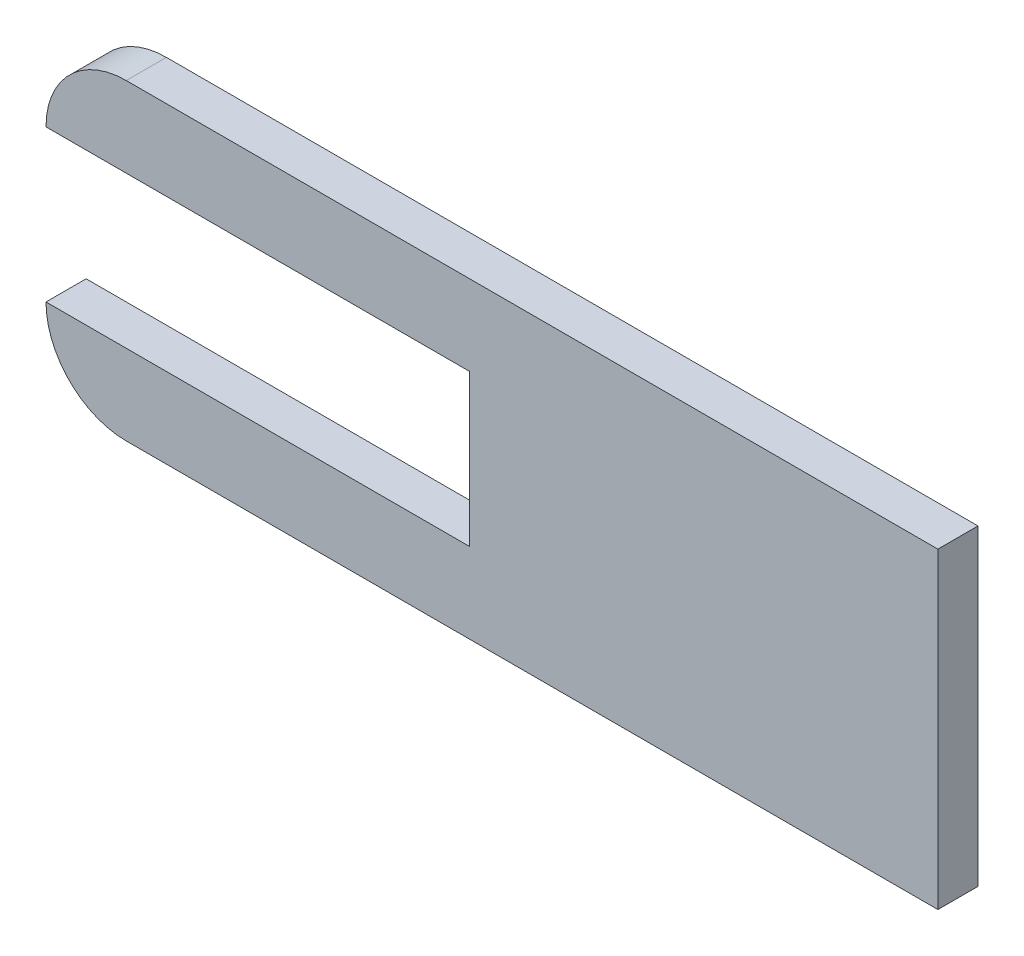
ISO-10303-21;
HEADER;
FILE_DESCRIPTION(('STEP AP214'),'2;1');
FILE_NAME('part.step','',(''),(''),'','','');
FILE_SCHEMA(('AUTOMOTIVE_DESIGN { 1 0 10303 214 1 1 1 1 }'));
ENDSEC;
DATA;
#1=APPLICATION_CONTEXT('core data for automotive mechanical design processes');
#2=APPLICATION_PROTOCOL_DEFINITION('international standard','automotive_design',2000,#1);
#3=PRODUCT_CONTEXT('',#1,'mechanical');
#4=PRODUCT('Part','Part','',(#3));
#5=PRODUCT_RELATED_PRODUCT_CATEGORY('part','',(#4));
#6=PRODUCT_DEFINITION_FORMATION('','',#4);
#7=PRODUCT_DEFINITION_CONTEXT('part definition',#1,'design');
#8=PRODUCT_DEFINITION('design','',#6,#7);
#9=PRODUCT_DEFINITION_SHAPE('','',#8);
#10=(LENGTH_UNIT() NAMED_UNIT(*) SI_UNIT(.MILLI.,.METRE.));
#11=(NAMED_UNIT(*) PLANE_ANGLE_UNIT() SI_UNIT($,.RADIAN.));
#12=(NAMED_UNIT(*) SI_UNIT($,.STERADIAN.) SOLID_ANGLE_UNIT());
#13=UNCERTAINTY_MEASURE_WITH_UNIT(LENGTH_MEASURE(1.E-05),#10,'distance_accuracy_value','');
#14=(GEOMETRIC_REPRESENTATION_CONTEXT(3) GLOBAL_UNCERTAINTY_ASSIGNED_CONTEXT((#13)) GLOBAL_UNIT_ASSIGNED_CONTEXT((#10,
#11,#12)) REPRESENTATION_CONTEXT('',''));
#15=CARTESIAN_POINT('',(0.,0.,0.));
#16=DIRECTION('',(0.,0.,1.));
#17=DIRECTION('',(1.,0.,0.));
#18=AXIS2_PLACEMENT_3D('',#15,#16,#17);
#19=CARTESIAN_POINT('',(22.86,22.86,11.43));
#20=DIRECTION('',(0.,0.,-1.));
#21=DIRECTION('',(-1.,0.,0.));
#22=AXIS2_PLACEMENT_3D('',#19,#20,#21);
#23=CYLINDRICAL_SURFACE('',#22,22.86);
#24=DIRECTION('',(0.,0.,-1.));
#25=VECTOR('',#24,1.);
#26=CARTESIAN_POINT('',(22.86,0.,11.43));
#27=LINE('',#26,#25);
#28=CARTESIAN_POINT('',(22.86,0.,11.43));
#29=VERTEX_POINT('',#28);
#30=CARTESIAN_POINT('',(22.86,0.,0.));
#31=VERTEX_POINT('',#30);
#32=EDGE_CURVE('E151',#29,#31,#27,.T.);
#33=ORIENTED_EDGE('',*,*,#32,.F.);
#34=CARTESIAN_POINT('',(22.86,22.86,11.43));
#35=DIRECTION('',(0.,0.,-1.));
#36=DIRECTION('',(-1.,0.,0.));
#37=AXIS2_PLACEMENT_3D('',#34,#35,#36);
#38=CIRCLE('',#37,22.86);
#39=CARTESIAN_POINT('',(0.,22.86,11.43));
#40=VERTEX_POINT('',#39);
#41=EDGE_CURVE('E40',#40,#29,#38,.F.);
#42=ORIENTED_EDGE('',*,*,#41,.F.);
#43=DIRECTION('',(0.,0.,-1.));
#44=VECTOR('',#43,1.);
#45=CARTESIAN_POINT('',(0.,22.86,11.43));
#46=LINE('',#45,#44);
#47=CARTESIAN_POINT('',(0.,22.86,0.));
#48=VERTEX_POINT('',#47);
#49=EDGE_CURVE('E154',#48,#40,#46,.F.);
#50=ORIENTED_EDGE('',*,*,#49,.F.);
#51=CARTESIAN_POINT('',(22.86,22.86,0.));
#52=DIRECTION('',(0.,0.,-1.));
#53=DIRECTION('',(-1.,0.,0.));
#54=AXIS2_PLACEMENT_3D('',#51,#52,#53);
#55=CIRCLE('',#54,22.86);
#56=EDGE_CURVE('E11',#31,#48,#55,.T.);
#57=ORIENTED_EDGE('',*,*,#56,.F.);
#58=EDGE_LOOP('',(#33,#42,#50,#57));
#59=FACE_BOUND('',#58,.T.);
#60=ADVANCED_FACE('F33',(#59),#23,.T.);
#61=CARTESIAN_POINT('',(22.86,66.04,11.43));
#62=DIRECTION('',(0.,0.,-1.));
#63=DIRECTION('',(-1.,0.,0.));
#64=AXIS2_PLACEMENT_3D('',#61,#62,#63);
#65=CYLINDRICAL_SURFACE('',#64,22.86);
#66=DIRECTION('',(0.,0.,-1.));
#67=VECTOR('',#66,1.);
#68=CARTESIAN_POINT('',(0.,66.04,11.43));
#69=LINE('',#68,#67);
#70=CARTESIAN_POINT('',(0.,66.04,11.43));
#71=VERTEX_POINT('',#70);
#72=CARTESIAN_POINT('',(0.,66.04,0.));
#73=VERTEX_POINT('',#72);
#74=EDGE_CURVE('E141',#71,#73,#69,.T.);
#75=ORIENTED_EDGE('',*,*,#74,.F.);
#76=CARTESIAN_POINT('',(22.86,66.04,11.43));
#77=DIRECTION('',(0.,0.,-1.));
#78=DIRECTION('',(-1.,0.,0.));
#79=AXIS2_PLACEMENT_3D('',#76,#77,#78);
#80=CIRCLE('',#79,22.86);
#81=CARTESIAN_POINT('',(22.86,88.9,11.43));
#82=VERTEX_POINT('',#81);
#83=EDGE_CURVE('E146',#82,#71,#80,.F.);
#84=ORIENTED_EDGE('',*,*,#83,.F.);
#85=DIRECTION('',(0.,0.,-1.));
#86=VECTOR('',#85,1.);
#87=CARTESIAN_POINT('',(22.86,88.9,11.43));
#88=LINE('',#87,#86);
#89=CARTESIAN_POINT('',(22.86,88.9,0.));
#90=VERTEX_POINT('',#89);
#91=EDGE_CURVE('E143',#90,#82,#88,.F.);
#92=ORIENTED_EDGE('',*,*,#91,.F.);
#93=CARTESIAN_POINT('',(22.86,66.04,0.));
#94=DIRECTION('',(0.,0.,-1.));
#95=DIRECTION('',(-1.,0.,0.));
#96=AXIS2_PLACEMENT_3D('',#93,#94,#95);
#97=CIRCLE('',#96,22.86);
#98=EDGE_CURVE('E149',#73,#90,#97,.T.);
#99=ORIENTED_EDGE('',*,*,#98,.F.);
#100=EDGE_LOOP('',(#75,#84,#92,#99));
#101=FACE_BOUND('',#100,.T.);
#102=ADVANCED_FACE('F175',(#101),#65,.T.);
#103=CARTESIAN_POINT('',(0.,0.,11.43));
#104=DIRECTION('',(0.,1.,0.));
#105=DIRECTION('',(0.,0.,1.));
#106=AXIS2_PLACEMENT_3D('',#103,#104,#105);
#107=PLANE('',#106);
#108=DIRECTION('',(1.,0.,0.));
#109=VECTOR('',#108,1.);
#110=CARTESIAN_POINT('',(0.,0.,11.43));
#111=LINE('',#110,#109);
#112=CARTESIAN_POINT('',(254.,0.,11.43));
#113=VERTEX_POINT('',#112);
#114=EDGE_CURVE('E120',#29,#113,#111,.T.);
#115=ORIENTED_EDGE('',*,*,#114,.F.);
#116=ORIENTED_EDGE('',*,*,#32,.T.);
#117=DIRECTION('',(1.,0.,0.));
#118=VECTOR('',#117,1.);
#119=CARTESIAN_POINT('',(0.,0.,0.));
#120=LINE('',#119,#118);
#121=CARTESIAN_POINT('',(254.,0.,0.));
#122=VERTEX_POINT('',#121);
#123=EDGE_CURVE('E129',#31,#122,#120,.T.);
#124=ORIENTED_EDGE('',*,*,#123,.T.);
#125=DIRECTION('',(0.,0.,-1.));
#126=VECTOR('',#125,1.);
#127=CARTESIAN_POINT('',(254.,0.,11.43));
#128=LINE('',#127,#126);
#129=EDGE_CURVE('E138',#113,#122,#128,.T.);
#130=ORIENTED_EDGE('',*,*,#129,.F.);
#131=EDGE_LOOP('',(#115,#116,#124,#130));
#132=FACE_BOUND('',#131,.T.);
#133=ADVANCED_FACE('F161',(#132),#107,.F.);
#134=CARTESIAN_POINT('',(254.,0.,11.43));
#135=DIRECTION('',(-1.,0.,0.));
#136=DIRECTION('',(0.,0.,1.));
#137=AXIS2_PLACEMENT_3D('',#134,#135,#136);
#138=PLANE('',#137);
#139=DIRECTION('',(0.,1.,0.));
#140=VECTOR('',#139,1.);
#141=CARTESIAN_POINT('',(254.,0.,0.));
#142=LINE('',#141,#140);
#143=CARTESIAN_POINT('',(254.,88.9,0.));
#144=VERTEX_POINT('',#143);
#145=EDGE_CURVE('E131',#122,#144,#142,.T.);
#146=ORIENTED_EDGE('',*,*,#145,.T.);
#147=DIRECTION('',(0.,0.,-1.));
#148=VECTOR('',#147,1.);
#149=CARTESIAN_POINT('',(254.,88.9,11.43));
#150=LINE('',#149,#148);
#151=CARTESIAN_POINT('',(254.,88.9,11.43));
#152=VERTEX_POINT('',#151);
#153=EDGE_CURVE('E128',#152,#144,#150,.T.);
#154=ORIENTED_EDGE('',*,*,#153,.F.);
#155=DIRECTION('',(0.,1.,0.));
#156=VECTOR('',#155,1.);
#157=CARTESIAN_POINT('',(254.,0.,11.43));
#158=LINE('',#157,#156);
#159=EDGE_CURVE('E122',#113,#152,#158,.T.);
#160=ORIENTED_EDGE('',*,*,#159,.F.);
#161=ORIENTED_EDGE('',*,*,#129,.T.);
#162=EDGE_LOOP('',(#146,#154,#160,#161));
#163=FACE_BOUND('',#162,.T.);
#164=ADVANCED_FACE('F166',(#163),#138,.F.);
#165=CARTESIAN_POINT('',(0.,88.9,11.43));
#166=DIRECTION('',(0.,-1.,0.));
#167=DIRECTION('',(0.,0.,-1.));
#168=AXIS2_PLACEMENT_3D('',#165,#166,#167);
#169=PLANE('',#168);
#170=DIRECTION('',(-1.,0.,0.));
#171=VECTOR('',#170,1.);
#172=CARTESIAN_POINT('',(0.,88.9,0.));
#173=LINE('',#172,#171);
#174=EDGE_CURVE('E123',#144,#90,#173,.T.);
#175=ORIENTED_EDGE('',*,*,#174,.T.);
#176=ORIENTED_EDGE('',*,*,#91,.T.);
#177=DIRECTION('',(-1.,0.,0.));
#178=VECTOR('',#177,1.);
#179=CARTESIAN_POINT('',(0.,88.9,11.43));
#180=LINE('',#179,#178);
#181=EDGE_CURVE('E125',#152,#82,#180,.T.);
#182=ORIENTED_EDGE('',*,*,#181,.F.);
#183=ORIENTED_EDGE('',*,*,#153,.T.);
#184=EDGE_LOOP('',(#175,#176,#182,#183));
#185=FACE_BOUND('',#184,.T.);
#186=ADVANCED_FACE('F170',(#185),#169,.F.);
#187=CARTESIAN_POINT('',(0.,0.,11.43));
#188=DIRECTION('',(0.,0.,-1.));
#189=DIRECTION('',(-1.,0.,0.));
#190=AXIS2_PLACEMENT_3D('',#187,#188,#189);
#191=PLANE('',#190);
#192=ORIENTED_EDGE('',*,*,#83,.T.);
#193=DIRECTION('',(-1.,0.,0.));
#194=VECTOR('',#193,1.);
#195=CARTESIAN_POINT('',(120.65,66.04,11.43));
#196=LINE('',#195,#194);
#197=CARTESIAN_POINT('',(120.65,66.04,11.43));
#198=VERTEX_POINT('',#197);
#199=EDGE_CURVE('E115',#198,#71,#196,.T.);
#200=ORIENTED_EDGE('',*,*,#199,.F.);
#201=DIRECTION('',(0.,1.,0.));
#202=VECTOR('',#201,1.);
#203=CARTESIAN_POINT('',(120.65,22.86,11.43));
#204=LINE('',#203,#202);
#205=CARTESIAN_POINT('',(120.65,22.86,11.43));
#206=VERTEX_POINT('',#205);
#207=EDGE_CURVE('E103',#206,#198,#204,.T.);
#208=ORIENTED_EDGE('',*,*,#207,.F.);
#209=DIRECTION('',(-1.,0.,0.));
#210=VECTOR('',#209,1.);
#211=CARTESIAN_POINT('',(120.65,22.86,11.43));
#212=LINE('',#211,#210);
#213=EDGE_CURVE('E101',#206,#40,#212,.T.);
#214=ORIENTED_EDGE('',*,*,#213,.T.);
#215=ORIENTED_EDGE('',*,*,#41,.T.);
#216=ORIENTED_EDGE('',*,*,#114,.T.);
#217=ORIENTED_EDGE('',*,*,#159,.T.);
#218=ORIENTED_EDGE('',*,*,#181,.T.);
#219=EDGE_LOOP('',(#192,#200,#208,#214,#215,#216,#217,#218));
#220=FACE_BOUND('',#219,.T.);
#221=ADVANCED_FACE('F156',(#220),#191,.F.);
#222=CARTESIAN_POINT('',(0.,0.,0.));
#223=DIRECTION('',(0.,0.,-1.));
#224=DIRECTION('',(-1.,0.,0.));
#225=AXIS2_PLACEMENT_3D('',#222,#223,#224);
#226=PLANE('',#225);
#227=DIRECTION('',(-1.,0.,0.));
#228=VECTOR('',#227,1.);
#229=CARTESIAN_POINT('',(120.65,66.04,0.));
#230=LINE('',#229,#228);
#231=CARTESIAN_POINT('',(120.65,66.04,0.));
#232=VERTEX_POINT('',#231);
#233=EDGE_CURVE('E132',#232,#73,#230,.T.);
#234=ORIENTED_EDGE('',*,*,#233,.T.);
#235=ORIENTED_EDGE('',*,*,#98,.T.);
#236=ORIENTED_EDGE('',*,*,#174,.F.);
#237=ORIENTED_EDGE('',*,*,#145,.F.);
#238=ORIENTED_EDGE('',*,*,#123,.F.);
#239=ORIENTED_EDGE('',*,*,#56,.T.);
#240=DIRECTION('',(-1.,0.,0.));
#241=VECTOR('',#240,1.);
#242=CARTESIAN_POINT('',(120.65,22.86,0.));
#243=LINE('',#242,#241);
#244=CARTESIAN_POINT('',(120.65,22.86,0.));
#245=VERTEX_POINT('',#244);
#246=EDGE_CURVE('E100',#245,#48,#243,.T.);
#247=ORIENTED_EDGE('',*,*,#246,.F.);
#248=DIRECTION('',(0.,-1.,0.));
#249=VECTOR('',#248,1.);
#250=CARTESIAN_POINT('',(120.65,22.86,0.));
#251=LINE('',#250,#249);
#252=EDGE_CURVE('E104',#232,#245,#251,.T.);
#253=ORIENTED_EDGE('',*,*,#252,.F.);
#254=EDGE_LOOP('',(#234,#235,#236,#237,#238,#239,#247,#253));
#255=FACE_BOUND('',#254,.T.);
#256=ADVANCED_FACE('F111',(#255),#226,.T.);
#257=CARTESIAN_POINT('',(120.65,66.04,0.));
#258=DIRECTION('',(0.,1.,0.));
#259=DIRECTION('',(0.,0.,1.));
#260=AXIS2_PLACEMENT_3D('',#257,#258,#259);
#261=PLANE('',#260);
#262=ORIENTED_EDGE('',*,*,#74,.T.);
#263=ORIENTED_EDGE('',*,*,#233,.F.);
#264=DIRECTION('',(0.,0.,-1.));
#265=VECTOR('',#264,1.);
#266=CARTESIAN_POINT('',(120.65,66.04,0.));
#267=LINE('',#266,#265);
#268=EDGE_CURVE('E47',#198,#232,#267,.T.);
#269=ORIENTED_EDGE('',*,*,#268,.F.);
#270=ORIENTED_EDGE('',*,*,#199,.T.);
#271=EDGE_LOOP('',(#262,#263,#269,#270));
#272=FACE_BOUND('',#271,.T.);
#273=ADVANCED_FACE('F179',(#272),#261,.F.);
#274=CARTESIAN_POINT('',(120.65,22.86,0.));
#275=DIRECTION('',(0.,-1.,0.));
#276=DIRECTION('',(0.,0.,-1.));
#277=AXIS2_PLACEMENT_3D('',#274,#275,#276);
#278=PLANE('',#277);
#279=ORIENTED_EDGE('',*,*,#49,.T.);
#280=ORIENTED_EDGE('',*,*,#213,.F.);
#281=DIRECTION('',(0.,0.,1.));
#282=VECTOR('',#281,1.);
#283=CARTESIAN_POINT('',(120.65,22.86,0.));
#284=LINE('',#283,#282);
#285=EDGE_CURVE('E97',#245,#206,#284,.T.);
#286=ORIENTED_EDGE('',*,*,#285,.F.);
#287=ORIENTED_EDGE('',*,*,#246,.T.);
#288=EDGE_LOOP('',(#279,#280,#286,#287));
#289=FACE_BOUND('',#288,.T.);
#290=ADVANCED_FACE('F98',(#289),#278,.F.);
#291=CARTESIAN_POINT('',(120.65,0.,0.));
#292=DIRECTION('',(1.,0.,0.));
#293=DIRECTION('',(0.,0.,-1.));
#294=AXIS2_PLACEMENT_3D('',#291,#292,#293);
#295=PLANE('',#294);
#296=ORIENTED_EDGE('',*,*,#252,.T.);
#297=ORIENTED_EDGE('',*,*,#285,.T.);
#298=ORIENTED_EDGE('',*,*,#207,.T.);
#299=ORIENTED_EDGE('',*,*,#268,.T.);
#300=EDGE_LOOP('',(#296,#297,#298,#299));
#301=FACE_BOUND('',#300,.T.);
#302=ADVANCED_FACE('F107',(#301),#295,.F.);
#303=CLOSED_SHELL('',(#60,#102,#133,#164,#186,#221,#256,#273,#290,#302));
#304=MANIFOLD_SOLID_BREP('B2',#303);
#305=ADVANCED_BREP_SHAPE_REPRESENTATION('',(#18,#304),#14);
#306=SHAPE_DEFINITION_REPRESENTATION(#9,#305);
ENDSEC;
END-ISO-10303-21;
